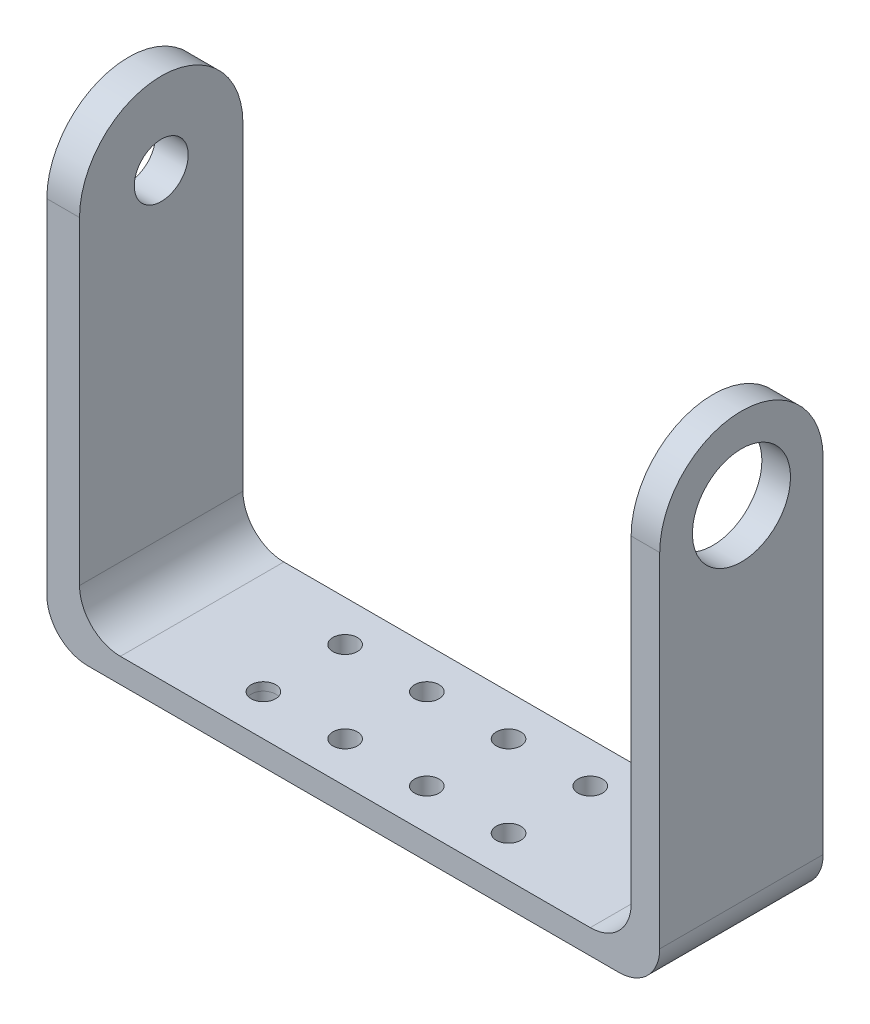
ISO-10303-21;
HEADER;
FILE_DESCRIPTION(('STEP AP214'),'2;1');
FILE_NAME('part.step','',(''),(''),'','','');
FILE_SCHEMA(('AUTOMOTIVE_DESIGN { 1 0 10303 214 1 1 1 1 }'));
ENDSEC;
DATA;
#1=APPLICATION_CONTEXT('core data for automotive mechanical design processes');
#2=APPLICATION_PROTOCOL_DEFINITION('international standard','automotive_design',2000,#1);
#3=PRODUCT_CONTEXT('',#1,'mechanical');
#4=PRODUCT('Part','Part','',(#3));
#5=PRODUCT_RELATED_PRODUCT_CATEGORY('part','',(#4));
#6=PRODUCT_DEFINITION_FORMATION('','',#4);
#7=PRODUCT_DEFINITION_CONTEXT('part definition',#1,'design');
#8=PRODUCT_DEFINITION('design','',#6,#7);
#9=PRODUCT_DEFINITION_SHAPE('','',#8);
#10=(LENGTH_UNIT() NAMED_UNIT(*) SI_UNIT(.MILLI.,.METRE.));
#11=(NAMED_UNIT(*) PLANE_ANGLE_UNIT() SI_UNIT($,.RADIAN.));
#12=(NAMED_UNIT(*) SI_UNIT($,.STERADIAN.) SOLID_ANGLE_UNIT());
#13=UNCERTAINTY_MEASURE_WITH_UNIT(LENGTH_MEASURE(1.E-05),#10,'distance_accuracy_value','');
#14=(GEOMETRIC_REPRESENTATION_CONTEXT(3) GLOBAL_UNCERTAINTY_ASSIGNED_CONTEXT((#13)) GLOBAL_UNIT_ASSIGNED_CONTEXT((#10,
#11,#12)) REPRESENTATION_CONTEXT('',''));
#15=CARTESIAN_POINT('',(0.,0.,0.));
#16=DIRECTION('',(0.,0.,1.));
#17=DIRECTION('',(1.,0.,0.));
#18=AXIS2_PLACEMENT_3D('',#15,#16,#17);
#19=CARTESIAN_POINT('',(30.,8.,-10.));
#20=DIRECTION('',(0.,0.,-1.));
#21=DIRECTION('',(-1.,0.,0.));
#22=AXIS2_PLACEMENT_3D('',#19,#20,#21);
#23=CYLINDRICAL_SURFACE('',#22,5.);
#24=DIRECTION('',(0.,0.,1.));
#25=VECTOR('',#24,1.);
#26=CARTESIAN_POINT('',(35.,8.,-10.));
#27=LINE('',#26,#25);
#28=CARTESIAN_POINT('',(35.,8.,-10.));
#29=VERTEX_POINT('',#28);
#30=CARTESIAN_POINT('',(35.,8.,10.));
#31=VERTEX_POINT('',#30);
#32=EDGE_CURVE('E273',#29,#31,#27,.T.);
#33=ORIENTED_EDGE('',*,*,#32,.F.);
#34=CARTESIAN_POINT('',(30.,8.,-10.));
#35=DIRECTION('',(0.,0.,1.));
#36=DIRECTION('',(1.,0.,0.));
#37=AXIS2_PLACEMENT_3D('',#34,#35,#36);
#38=CIRCLE('',#37,5.);
#39=CARTESIAN_POINT('',(30.,3.,-10.));
#40=VERTEX_POINT('',#39);
#41=EDGE_CURVE('E279',#29,#40,#38,.F.);
#42=ORIENTED_EDGE('',*,*,#41,.T.);
#43=DIRECTION('',(0.,0.,1.));
#44=VECTOR('',#43,1.);
#45=CARTESIAN_POINT('',(30.,3.,-10.));
#46=LINE('',#45,#44);
#47=CARTESIAN_POINT('',(30.,3.,9.99999999999999));
#48=VERTEX_POINT('',#47);
#49=EDGE_CURVE('E276',#48,#40,#46,.F.);
#50=ORIENTED_EDGE('',*,*,#49,.F.);
#51=CARTESIAN_POINT('',(30.,8.,10.));
#52=DIRECTION('',(0.,0.,-1.));
#53=DIRECTION('',(-1.,0.,0.));
#54=AXIS2_PLACEMENT_3D('',#51,#52,#53);
#55=CIRCLE('',#54,5.);
#56=EDGE_CURVE('E281',#48,#31,#55,.F.);
#57=ORIENTED_EDGE('',*,*,#56,.T.);
#58=EDGE_LOOP('',(#33,#42,#50,#57));
#59=FACE_BOUND('',#58,.T.);
#60=ADVANCED_FACE('F77',(#59),#23,.F.);
#61=CARTESIAN_POINT('',(-27.5,8.,0.));
#62=DIRECTION('',(0.,0.,-1.));
#63=DIRECTION('',(-1.,0.,0.));
#64=AXIS2_PLACEMENT_3D('',#61,#62,#63);
#65=CYLINDRICAL_SURFACE('',#64,5.);
#66=DIRECTION('',(0.,0.,1.));
#67=VECTOR('',#66,1.);
#68=CARTESIAN_POINT('',(-27.5,3.,0.));
#69=LINE('',#68,#67);
#70=CARTESIAN_POINT('',(-27.5,3.,-10.));
#71=VERTEX_POINT('',#70);
#72=CARTESIAN_POINT('',(-27.5,3.,9.99999999999999));
#73=VERTEX_POINT('',#72);
#74=EDGE_CURVE('E254',#71,#73,#69,.T.);
#75=ORIENTED_EDGE('',*,*,#74,.F.);
#76=CARTESIAN_POINT('',(-27.5,8.,-10.));
#77=DIRECTION('',(0.,0.,1.));
#78=DIRECTION('',(1.,0.,0.));
#79=AXIS2_PLACEMENT_3D('',#76,#77,#78);
#80=CIRCLE('',#79,5.);
#81=CARTESIAN_POINT('',(-32.5,8.,-10.));
#82=VERTEX_POINT('',#81);
#83=EDGE_CURVE('E269',#71,#82,#80,.F.);
#84=ORIENTED_EDGE('',*,*,#83,.T.);
#85=DIRECTION('',(0.,0.,1.));
#86=VECTOR('',#85,1.);
#87=CARTESIAN_POINT('',(-32.5,8.,0.));
#88=LINE('',#87,#86);
#89=CARTESIAN_POINT('',(-32.5,8.,10.));
#90=VERTEX_POINT('',#89);
#91=EDGE_CURVE('E266',#90,#82,#88,.F.);
#92=ORIENTED_EDGE('',*,*,#91,.F.);
#93=CARTESIAN_POINT('',(-27.5,8.,10.0000000000001));
#94=DIRECTION('',(0.,0.,-1.));
#95=DIRECTION('',(-1.,0.,0.));
#96=AXIS2_PLACEMENT_3D('',#93,#94,#95);
#97=CIRCLE('',#96,5.);
#98=EDGE_CURVE('E271',#90,#73,#97,.F.);
#99=ORIENTED_EDGE('',*,*,#98,.T.);
#100=EDGE_LOOP('',(#75,#84,#92,#99));
#101=FACE_BOUND('',#100,.T.);
#102=ADVANCED_FACE('F320',(#101),#65,.F.);
#103=CARTESIAN_POINT('',(-32.5,57.,-10.));
#104=DIRECTION('',(-1.,0.,0.));
#105=DIRECTION('',(0.,0.,1.));
#106=AXIS2_PLACEMENT_3D('',#103,#104,#105);
#107=PLANE('',#106);
#108=CARTESIAN_POINT('',(-32.5,47.,0.));
#109=DIRECTION('',(-1.,0.,0.));
#110=DIRECTION('',(0.,0.,1.));
#111=AXIS2_PLACEMENT_3D('',#108,#109,#110);
#112=CIRCLE('',#111,3.3);
#113=CARTESIAN_POINT('',(-32.5,47.,3.30000000000005));
#114=VERTEX_POINT('',#113);
#115=EDGE_CURVE('E197',#114,#114,#112,.T.);
#116=ORIENTED_EDGE('',*,*,#115,.T.);
#117=EDGE_LOOP('',(#116));
#118=FACE_BOUND('',#117,.T.);
#119=DIRECTION('',(0.,-1.,0.));
#120=VECTOR('',#119,1.);
#121=CARTESIAN_POINT('',(-32.5,57.,10.));
#122=LINE('',#121,#120);
#123=CARTESIAN_POINT('',(-32.5,47.,9.99999999999999));
#124=VERTEX_POINT('',#123);
#125=EDGE_CURVE('E224',#124,#90,#122,.T.);
#126=ORIENTED_EDGE('',*,*,#125,.T.);
#127=ORIENTED_EDGE('',*,*,#91,.T.);
#128=DIRECTION('',(0.,-1.,0.));
#129=VECTOR('',#128,1.);
#130=CARTESIAN_POINT('',(-32.5,57.,-10.));
#131=LINE('',#130,#129);
#132=CARTESIAN_POINT('',(-32.5,47.,-10.));
#133=VERTEX_POINT('',#132);
#134=EDGE_CURVE('E219',#133,#82,#131,.T.);
#135=ORIENTED_EDGE('',*,*,#134,.F.);
#136=CARTESIAN_POINT('',(-32.5,47.,0.));
#137=DIRECTION('',(-1.,0.,0.));
#138=DIRECTION('',(0.,0.,1.));
#139=AXIS2_PLACEMENT_3D('',#136,#137,#138);
#140=CIRCLE('',#139,10.);
#141=EDGE_CURVE('E184',#124,#133,#140,.T.);
#142=ORIENTED_EDGE('',*,*,#141,.F.);
#143=EDGE_LOOP('',(#126,#127,#135,#142));
#144=FACE_BOUND('',#143,.T.);
#145=ADVANCED_FACE('F314',(#118,#144),#107,.F.);
#146=CARTESIAN_POINT('',(35.,57.,-10.));
#147=DIRECTION('',(1.,0.,0.));
#148=DIRECTION('',(0.,0.,-1.));
#149=AXIS2_PLACEMENT_3D('',#146,#147,#148);
#150=PLANE('',#149);
#151=CARTESIAN_POINT('',(35.,47.,0.));
#152=DIRECTION('',(1.,0.,0.));
#153=DIRECTION('',(0.,0.,-1.));
#154=AXIS2_PLACEMENT_3D('',#151,#152,#153);
#155=CIRCLE('',#154,6.);
#156=CARTESIAN_POINT('',(35.,47.,-6.00000000000001));
#157=VERTEX_POINT('',#156);
#158=EDGE_CURVE('E203',#157,#157,#155,.T.);
#159=ORIENTED_EDGE('',*,*,#158,.T.);
#160=EDGE_LOOP('',(#159));
#161=FACE_BOUND('',#160,.T.);
#162=DIRECTION('',(0.,-1.,0.));
#163=VECTOR('',#162,1.);
#164=CARTESIAN_POINT('',(35.,57.,-10.));
#165=LINE('',#164,#163);
#166=CARTESIAN_POINT('',(35.,47.,-10.));
#167=VERTEX_POINT('',#166);
#168=EDGE_CURVE('E216',#167,#29,#165,.T.);
#169=ORIENTED_EDGE('',*,*,#168,.T.);
#170=ORIENTED_EDGE('',*,*,#32,.T.);
#171=DIRECTION('',(0.,-1.,0.));
#172=VECTOR('',#171,1.);
#173=CARTESIAN_POINT('',(35.,57.,10.));
#174=LINE('',#173,#172);
#175=CARTESIAN_POINT('',(35.,47.,9.99999999999999));
#176=VERTEX_POINT('',#175);
#177=EDGE_CURVE('E213',#176,#31,#174,.T.);
#178=ORIENTED_EDGE('',*,*,#177,.F.);
#179=CARTESIAN_POINT('',(35.,47.,0.));
#180=DIRECTION('',(1.,0.,0.));
#181=DIRECTION('',(0.,0.,-1.));
#182=AXIS2_PLACEMENT_3D('',#179,#180,#181);
#183=CIRCLE('',#182,10.);
#184=EDGE_CURVE('E185',#167,#176,#183,.T.);
#185=ORIENTED_EDGE('',*,*,#184,.F.);
#186=EDGE_LOOP('',(#169,#170,#178,#185));
#187=FACE_BOUND('',#186,.T.);
#188=ADVANCED_FACE('F456',(#161,#187),#150,.F.);
#189=CARTESIAN_POINT('',(38.5,2.,-10.));
#190=DIRECTION('',(-1.,0.,0.));
#191=DIRECTION('',(0.,0.,1.));
#192=AXIS2_PLACEMENT_3D('',#189,#190,#191);
#193=PLANE('',#192);
#194=CARTESIAN_POINT('',(38.5,47.,0.));
#195=DIRECTION('',(1.,0.,0.));
#196=DIRECTION('',(0.,0.,-1.));
#197=AXIS2_PLACEMENT_3D('',#194,#195,#196);
#198=CIRCLE('',#197,6.);
#199=CARTESIAN_POINT('',(38.5,47.,-6.00000000000001));
#200=VERTEX_POINT('',#199);
#201=EDGE_CURVE('E200',#200,#200,#198,.T.);
#202=ORIENTED_EDGE('',*,*,#201,.F.);
#203=EDGE_LOOP('',(#202));
#204=FACE_BOUND('',#203,.T.);
#205=DIRECTION('',(0.,-1.,0.));
#206=VECTOR('',#205,1.);
#207=CARTESIAN_POINT('',(38.5,2.,9.99999999999999));
#208=LINE('',#207,#206);
#209=CARTESIAN_POINT('',(38.5,47.,9.99999999999999));
#210=VERTEX_POINT('',#209);
#211=CARTESIAN_POINT('',(38.5,5.,9.99999999999999));
#212=VERTEX_POINT('',#211);
#213=EDGE_CURVE('E251',#210,#212,#208,.T.);
#214=ORIENTED_EDGE('',*,*,#213,.T.);
#215=DIRECTION('',(0.,0.,-1.));
#216=VECTOR('',#215,1.);
#217=CARTESIAN_POINT('',(38.5,5.,-10.));
#218=LINE('',#217,#216);
#219=CARTESIAN_POINT('',(38.5,5.,-10.));
#220=VERTEX_POINT('',#219);
#221=EDGE_CURVE('E283',#212,#220,#218,.T.);
#222=ORIENTED_EDGE('',*,*,#221,.T.);
#223=DIRECTION('',(0.,-1.,0.));
#224=VECTOR('',#223,1.);
#225=CARTESIAN_POINT('',(38.5,2.,-10.));
#226=LINE('',#225,#224);
#227=CARTESIAN_POINT('',(38.5,47.,-10.));
#228=VERTEX_POINT('',#227);
#229=EDGE_CURVE('E249',#228,#220,#226,.T.);
#230=ORIENTED_EDGE('',*,*,#229,.F.);
#231=CARTESIAN_POINT('',(38.5,47.,0.));
#232=DIRECTION('',(1.,0.,0.));
#233=DIRECTION('',(0.,0.,-1.));
#234=AXIS2_PLACEMENT_3D('',#231,#232,#233);
#235=CIRCLE('',#234,10.);
#236=EDGE_CURVE('E208',#228,#210,#235,.T.);
#237=ORIENTED_EDGE('',*,*,#236,.T.);
#238=EDGE_LOOP('',(#214,#222,#230,#237));
#239=FACE_BOUND('',#238,.T.);
#240=ADVANCED_FACE('F302',(#204,#239),#193,.F.);
#241=CARTESIAN_POINT('',(35.,2.,10.));
#242=DIRECTION('',(0.,0.,-1.));
#243=DIRECTION('',(-1.,0.,0.));
#244=AXIS2_PLACEMENT_3D('',#241,#242,#243);
#245=PLANE('',#244);
#246=DIRECTION('',(1.,0.,0.));
#247=VECTOR('',#246,1.);
#248=CARTESIAN_POINT('',(35.,0.,10.));
#249=LINE('',#248,#247);
#250=CARTESIAN_POINT('',(-31.5,0.,10.0000000000001));
#251=VERTEX_POINT('',#250);
#252=CARTESIAN_POINT('',(33.5,0.,10.));
#253=VERTEX_POINT('',#252);
#254=EDGE_CURVE('E245',#251,#253,#249,.T.);
#255=ORIENTED_EDGE('',*,*,#254,.T.);
#256=CARTESIAN_POINT('',(33.5,5.,10.));
#257=DIRECTION('',(0.,0.,-1.));
#258=DIRECTION('',(-1.,0.,0.));
#259=AXIS2_PLACEMENT_3D('',#256,#257,#258);
#260=CIRCLE('',#259,5.);
#261=EDGE_CURVE('E85',#253,#212,#260,.F.);
#262=ORIENTED_EDGE('',*,*,#261,.T.);
#263=ORIENTED_EDGE('',*,*,#213,.F.);
#264=DIRECTION('',(1.,0.,0.));
#265=VECTOR('',#264,1.);
#266=CARTESIAN_POINT('',(-48.5,47.,9.99999999999999));
#267=LINE('',#266,#265);
#268=EDGE_CURVE('E204',#176,#210,#267,.T.);
#269=ORIENTED_EDGE('',*,*,#268,.F.);
#270=ORIENTED_EDGE('',*,*,#177,.T.);
#271=ORIENTED_EDGE('',*,*,#56,.F.);
#272=DIRECTION('',(1.,0.,0.));
#273=VECTOR('',#272,1.);
#274=CARTESIAN_POINT('',(-32.5,3.,9.99999999999999));
#275=LINE('',#274,#273);
#276=EDGE_CURVE('E325',#73,#48,#275,.T.);
#277=ORIENTED_EDGE('',*,*,#276,.F.);
#278=ORIENTED_EDGE('',*,*,#98,.F.);
#279=ORIENTED_EDGE('',*,*,#125,.F.);
#280=CARTESIAN_POINT('',(-36.5,47.,9.99999999999999));
#281=VERTEX_POINT('',#280);
#282=EDGE_CURVE('E207',#281,#124,#267,.T.);
#283=ORIENTED_EDGE('',*,*,#282,.F.);
#284=DIRECTION('',(0.,-1.,0.));
#285=VECTOR('',#284,1.);
#286=CARTESIAN_POINT('',(-36.5,0.,10.));
#287=LINE('',#286,#285);
#288=CARTESIAN_POINT('',(-36.5,5.,10.));
#289=VERTEX_POINT('',#288);
#290=EDGE_CURVE('E177',#281,#289,#287,.T.);
#291=ORIENTED_EDGE('',*,*,#290,.T.);
#292=CARTESIAN_POINT('',(-31.5,5.,10.0000000000001));
#293=DIRECTION('',(0.,0.,-1.));
#294=DIRECTION('',(-1.,0.,0.));
#295=AXIS2_PLACEMENT_3D('',#292,#293,#294);
#296=CIRCLE('',#295,5.);
#297=EDGE_CURVE('E293',#289,#251,#296,.F.);
#298=ORIENTED_EDGE('',*,*,#297,.T.);
#299=EDGE_LOOP('',(#255,#262,#263,#269,#270,#271,#277,#278,#279,#283,#291,#298));
#300=FACE_BOUND('',#299,.T.);
#301=ADVANCED_FACE('F297',(#300),#245,.F.);
#302=CARTESIAN_POINT('',(0.,0.,0.));
#303=DIRECTION('',(0.,1.,0.));
#304=DIRECTION('',(0.,0.,1.));
#305=AXIS2_PLACEMENT_3D('',#302,#303,#304);
#306=PLANE('',#305);
#307=DIRECTION('',(-1.,0.,0.));
#308=VECTOR('',#307,1.);
#309=CARTESIAN_POINT('',(35.,0.,-10.));
#310=LINE('',#309,#308);
#311=CARTESIAN_POINT('',(33.5,0.,-10.));
#312=VERTEX_POINT('',#311);
#313=CARTESIAN_POINT('',(-31.5,0.,-10.));
#314=VERTEX_POINT('',#313);
#315=EDGE_CURVE('E247',#312,#314,#310,.T.);
#316=ORIENTED_EDGE('',*,*,#315,.F.);
#317=DIRECTION('',(0.,0.,-1.));
#318=VECTOR('',#317,1.);
#319=CARTESIAN_POINT('',(33.5,0.,0.));
#320=LINE('',#319,#318);
#321=EDGE_CURVE('E98',#312,#253,#320,.F.);
#322=ORIENTED_EDGE('',*,*,#321,.T.);
#323=ORIENTED_EDGE('',*,*,#254,.F.);
#324=DIRECTION('',(0.,0.,-1.));
#325=VECTOR('',#324,1.);
#326=CARTESIAN_POINT('',(-31.5,0.,-10.));
#327=LINE('',#326,#325);
#328=EDGE_CURVE('E289',#251,#314,#327,.T.);
#329=ORIENTED_EDGE('',*,*,#328,.T.);
#330=EDGE_LOOP('',(#316,#322,#323,#329));
#331=FACE_BOUND('',#330,.T.);
#332=CARTESIAN_POINT('',(-15.,0.,-5.));
#333=DIRECTION('',(0.,1.,0.));
#334=DIRECTION('',(0.,0.,1.));
#335=AXIS2_PLACEMENT_3D('',#332,#333,#334);
#336=CIRCLE('',#335,1.5);
#337=CARTESIAN_POINT('',(-15.,0.,-3.5));
#338=VERTEX_POINT('',#337);
#339=EDGE_CURVE('E242',#338,#338,#336,.T.);
#340=ORIENTED_EDGE('',*,*,#339,.T.);
#341=EDGE_LOOP('',(#340));
#342=FACE_BOUND('',#341,.T.);
#343=CARTESIAN_POINT('',(-5.,0.,-5.));
#344=DIRECTION('',(0.,1.,0.));
#345=DIRECTION('',(0.,0.,1.));
#346=AXIS2_PLACEMENT_3D('',#343,#344,#345);
#347=CIRCLE('',#346,1.5);
#348=CARTESIAN_POINT('',(-5.,0.,-3.5));
#349=VERTEX_POINT('',#348);
#350=EDGE_CURVE('E239',#349,#349,#347,.T.);
#351=ORIENTED_EDGE('',*,*,#350,.T.);
#352=EDGE_LOOP('',(#351));
#353=FACE_BOUND('',#352,.T.);
#354=CARTESIAN_POINT('',(-15.,0.,5.));
#355=DIRECTION('',(0.,1.,0.));
#356=DIRECTION('',(0.,0.,1.));
#357=AXIS2_PLACEMENT_3D('',#354,#355,#356);
#358=CIRCLE('',#357,1.5);
#359=CARTESIAN_POINT('',(-15.,0.,6.5));
#360=VERTEX_POINT('',#359);
#361=EDGE_CURVE('E236',#360,#360,#358,.T.);
#362=ORIENTED_EDGE('',*,*,#361,.T.);
#363=EDGE_LOOP('',(#362));
#364=FACE_BOUND('',#363,.T.);
#365=CARTESIAN_POINT('',(-5.,0.,5.));
#366=DIRECTION('',(0.,1.,0.));
#367=DIRECTION('',(0.,0.,1.));
#368=AXIS2_PLACEMENT_3D('',#365,#366,#367);
#369=CIRCLE('',#368,1.5);
#370=CARTESIAN_POINT('',(-5.,0.,6.5));
#371=VERTEX_POINT('',#370);
#372=EDGE_CURVE('E233',#371,#371,#369,.T.);
#373=ORIENTED_EDGE('',*,*,#372,.T.);
#374=EDGE_LOOP('',(#373));
#375=FACE_BOUND('',#374,.T.);
#376=CARTESIAN_POINT('',(15.,0.,5.));
#377=DIRECTION('',(0.,1.,0.));
#378=DIRECTION('',(0.,0.,-1.));
#379=AXIS2_PLACEMENT_3D('',#376,#377,#378);
#380=CIRCLE('',#379,1.5);
#381=CARTESIAN_POINT('',(15.,0.,3.5));
#382=VERTEX_POINT('',#381);
#383=EDGE_CURVE('E230',#382,#382,#380,.T.);
#384=ORIENTED_EDGE('',*,*,#383,.T.);
#385=EDGE_LOOP('',(#384));
#386=FACE_BOUND('',#385,.T.);
#387=CARTESIAN_POINT('',(5.,0.,5.));
#388=DIRECTION('',(0.,1.,0.));
#389=DIRECTION('',(0.,0.,-1.));
#390=AXIS2_PLACEMENT_3D('',#387,#388,#389);
#391=CIRCLE('',#390,1.5);
#392=CARTESIAN_POINT('',(5.,0.,3.5));
#393=VERTEX_POINT('',#392);
#394=EDGE_CURVE('E227',#393,#393,#391,.T.);
#395=ORIENTED_EDGE('',*,*,#394,.T.);
#396=EDGE_LOOP('',(#395));
#397=FACE_BOUND('',#396,.T.);
#398=CARTESIAN_POINT('',(5.,0.,-5.));
#399=DIRECTION('',(0.,1.,0.));
#400=DIRECTION('',(0.,0.,-1.));
#401=AXIS2_PLACEMENT_3D('',#398,#399,#400);
#402=CIRCLE('',#401,1.5);
#403=CARTESIAN_POINT('',(5.,0.,-6.5));
#404=VERTEX_POINT('',#403);
#405=EDGE_CURVE('E223',#404,#404,#402,.T.);
#406=ORIENTED_EDGE('',*,*,#405,.T.);
#407=EDGE_LOOP('',(#406));
#408=FACE_BOUND('',#407,.T.);
#409=CARTESIAN_POINT('',(15.,0.,-5.));
#410=DIRECTION('',(0.,1.,0.));
#411=DIRECTION('',(0.,0.,-1.));
#412=AXIS2_PLACEMENT_3D('',#409,#410,#411);
#413=CIRCLE('',#412,1.5);
#414=CARTESIAN_POINT('',(15.,0.,-6.5));
#415=VERTEX_POINT('',#414);
#416=EDGE_CURVE('E220',#415,#415,#413,.T.);
#417=ORIENTED_EDGE('',*,*,#416,.T.);
#418=EDGE_LOOP('',(#417));
#419=FACE_BOUND('',#418,.T.);
#420=ADVANCED_FACE('F305',(#331,#342,#353,#364,#375,#386,#397,#408,#419),#306,.F.);
#421=CARTESIAN_POINT('',(35.,2.,-10.));
#422=DIRECTION('',(0.,0.,1.));
#423=DIRECTION('',(1.,0.,0.));
#424=AXIS2_PLACEMENT_3D('',#421,#422,#423);
#425=PLANE('',#424);
#426=ORIENTED_EDGE('',*,*,#229,.T.);
#427=CARTESIAN_POINT('',(33.5,5.,-10.));
#428=DIRECTION('',(0.,0.,1.));
#429=DIRECTION('',(1.,0.,0.));
#430=AXIS2_PLACEMENT_3D('',#427,#428,#429);
#431=CIRCLE('',#430,5.);
#432=EDGE_CURVE('E287',#220,#312,#431,.F.);
#433=ORIENTED_EDGE('',*,*,#432,.T.);
#434=ORIENTED_EDGE('',*,*,#315,.T.);
#435=CARTESIAN_POINT('',(-31.5,5.,-10.));
#436=DIRECTION('',(0.,0.,1.));
#437=DIRECTION('',(1.,0.,0.));
#438=AXIS2_PLACEMENT_3D('',#435,#436,#437);
#439=CIRCLE('',#438,5.);
#440=CARTESIAN_POINT('',(-36.5,5.,-10.));
#441=VERTEX_POINT('',#440);
#442=EDGE_CURVE('E175',#314,#441,#439,.F.);
#443=ORIENTED_EDGE('',*,*,#442,.T.);
#444=DIRECTION('',(0.,1.,0.));
#445=VECTOR('',#444,1.);
#446=CARTESIAN_POINT('',(-36.5,0.,-10.));
#447=LINE('',#446,#445);
#448=CARTESIAN_POINT('',(-36.5,47.,-10.));
#449=VERTEX_POINT('',#448);
#450=EDGE_CURVE('E167',#441,#449,#447,.T.);
#451=ORIENTED_EDGE('',*,*,#450,.T.);
#452=DIRECTION('',(1.,0.,0.));
#453=VECTOR('',#452,1.);
#454=CARTESIAN_POINT('',(-48.5,47.,-10.));
#455=LINE('',#454,#453);
#456=EDGE_CURVE('E172',#449,#133,#455,.T.);
#457=ORIENTED_EDGE('',*,*,#456,.T.);
#458=ORIENTED_EDGE('',*,*,#134,.T.);
#459=ORIENTED_EDGE('',*,*,#83,.F.);
#460=DIRECTION('',(-1.,0.,0.));
#461=VECTOR('',#460,1.);
#462=CARTESIAN_POINT('',(-32.5,3.,-10.));
#463=LINE('',#462,#461);
#464=EDGE_CURVE('E318',#40,#71,#463,.T.);
#465=ORIENTED_EDGE('',*,*,#464,.F.);
#466=ORIENTED_EDGE('',*,*,#41,.F.);
#467=ORIENTED_EDGE('',*,*,#168,.F.);
#468=EDGE_CURVE('E186',#167,#228,#455,.T.);
#469=ORIENTED_EDGE('',*,*,#468,.T.);
#470=EDGE_LOOP('',(#426,#433,#434,#443,#451,#457,#458,#459,#465,#466,#467,#469));
#471=FACE_BOUND('',#470,.T.);
#472=ADVANCED_FACE('F170',(#471),#425,.F.);
#473=CARTESIAN_POINT('',(-15.,2.,-5.));
#474=DIRECTION('',(0.,-1.,0.));
#475=DIRECTION('',(0.,0.,-1.));
#476=AXIS2_PLACEMENT_3D('',#473,#474,#475);
#477=CYLINDRICAL_SURFACE('',#476,1.5);
#478=ORIENTED_EDGE('',*,*,#339,.F.);
#479=EDGE_LOOP('',(#478));
#480=FACE_BOUND('',#479,.T.);
#481=CARTESIAN_POINT('',(-15.,3.,-5.));
#482=DIRECTION('',(0.,1.,0.));
#483=DIRECTION('',(0.,0.,1.));
#484=AXIS2_PLACEMENT_3D('',#481,#482,#483);
#485=CIRCLE('',#484,1.5);
#486=CARTESIAN_POINT('',(-15.,3.,-3.5));
#487=VERTEX_POINT('',#486);
#488=EDGE_CURVE('E327',#487,#487,#485,.T.);
#489=ORIENTED_EDGE('',*,*,#488,.T.);
#490=EDGE_LOOP('',(#489));
#491=FACE_BOUND('',#490,.T.);
#492=ADVANCED_FACE('F496',(#480,#491),#477,.F.);
#493=CARTESIAN_POINT('',(-5.,2.,-5.));
#494=DIRECTION('',(0.,-1.,0.));
#495=DIRECTION('',(0.,0.,-1.));
#496=AXIS2_PLACEMENT_3D('',#493,#494,#495);
#497=CYLINDRICAL_SURFACE('',#496,1.5);
#498=ORIENTED_EDGE('',*,*,#350,.F.);
#499=EDGE_LOOP('',(#498));
#500=FACE_BOUND('',#499,.T.);
#501=CARTESIAN_POINT('',(-5.,3.,-5.));
#502=DIRECTION('',(0.,1.,0.));
#503=DIRECTION('',(0.,0.,1.));
#504=AXIS2_PLACEMENT_3D('',#501,#502,#503);
#505=CIRCLE('',#504,1.5);
#506=CARTESIAN_POINT('',(-5.,3.,-3.5));
#507=VERTEX_POINT('',#506);
#508=EDGE_CURVE('E331',#507,#507,#505,.T.);
#509=ORIENTED_EDGE('',*,*,#508,.T.);
#510=EDGE_LOOP('',(#509));
#511=FACE_BOUND('',#510,.T.);
#512=ADVANCED_FACE('F344',(#500,#511),#497,.F.);
#513=CARTESIAN_POINT('',(-15.,2.,5.));
#514=DIRECTION('',(0.,-1.,0.));
#515=DIRECTION('',(0.,0.,-1.));
#516=AXIS2_PLACEMENT_3D('',#513,#514,#515);
#517=CYLINDRICAL_SURFACE('',#516,1.5);
#518=CARTESIAN_POINT('',(-15.,2.,5.));
#519=DIRECTION('',(0.,-1.,0.));
#520=DIRECTION('',(0.,0.,-1.));
#521=AXIS2_PLACEMENT_3D('',#518,#519,#520);
#522=CIRCLE('',#521,1.5);
#523=CARTESIAN_POINT('',(-15.,2.,3.50000000000001));
#524=VERTEX_POINT('',#523);
#525=EDGE_CURVE('E192',#524,#524,#522,.T.);
#526=ORIENTED_EDGE('',*,*,#525,.F.);
#527=EDGE_LOOP('',(#526));
#528=FACE_BOUND('',#527,.T.);
#529=ORIENTED_EDGE('',*,*,#361,.F.);
#530=EDGE_LOOP('',(#529));
#531=FACE_BOUND('',#530,.T.);
#532=ADVANCED_FACE('F340',(#528,#531),#517,.F.);
#533=CARTESIAN_POINT('',(-5.,2.,5.));
#534=DIRECTION('',(0.,-1.,0.));
#535=DIRECTION('',(0.,0.,-1.));
#536=AXIS2_PLACEMENT_3D('',#533,#534,#535);
#537=CYLINDRICAL_SURFACE('',#536,1.5);
#538=ORIENTED_EDGE('',*,*,#372,.F.);
#539=EDGE_LOOP('',(#538));
#540=FACE_BOUND('',#539,.T.);
#541=CARTESIAN_POINT('',(-5.,3.,5.));
#542=DIRECTION('',(0.,1.,0.));
#543=DIRECTION('',(0.,0.,1.));
#544=AXIS2_PLACEMENT_3D('',#541,#542,#543);
#545=CIRCLE('',#544,1.5);
#546=CARTESIAN_POINT('',(-5.,3.,6.5));
#547=VERTEX_POINT('',#546);
#548=EDGE_CURVE('E397',#547,#547,#545,.T.);
#549=ORIENTED_EDGE('',*,*,#548,.T.);
#550=EDGE_LOOP('',(#549));
#551=FACE_BOUND('',#550,.T.);
#552=ADVANCED_FACE('F343',(#540,#551),#537,.F.);
#553=CARTESIAN_POINT('',(15.,2.,5.));
#554=DIRECTION('',(0.,-1.,0.));
#555=DIRECTION('',(0.,0.,-1.));
#556=AXIS2_PLACEMENT_3D('',#553,#554,#555);
#557=CYLINDRICAL_SURFACE('',#556,1.5);
#558=ORIENTED_EDGE('',*,*,#383,.F.);
#559=EDGE_LOOP('',(#558));
#560=FACE_BOUND('',#559,.T.);
#561=CARTESIAN_POINT('',(15.,3.,5.));
#562=DIRECTION('',(0.,1.,0.));
#563=DIRECTION('',(0.,0.,1.));
#564=AXIS2_PLACEMENT_3D('',#561,#562,#563);
#565=CIRCLE('',#564,1.5);
#566=CARTESIAN_POINT('',(15.,3.,6.5));
#567=VERTEX_POINT('',#566);
#568=EDGE_CURVE('E372',#567,#567,#565,.T.);
#569=ORIENTED_EDGE('',*,*,#568,.T.);
#570=EDGE_LOOP('',(#569));
#571=FACE_BOUND('',#570,.T.);
#572=ADVANCED_FACE('F410',(#560,#571),#557,.F.);
#573=CARTESIAN_POINT('',(5.,2.,5.));
#574=DIRECTION('',(0.,-1.,0.));
#575=DIRECTION('',(0.,0.,-1.));
#576=AXIS2_PLACEMENT_3D('',#573,#574,#575);
#577=CYLINDRICAL_SURFACE('',#576,1.5);
#578=ORIENTED_EDGE('',*,*,#394,.F.);
#579=EDGE_LOOP('',(#578));
#580=FACE_BOUND('',#579,.T.);
#581=CARTESIAN_POINT('',(5.,3.,5.));
#582=DIRECTION('',(0.,1.,0.));
#583=DIRECTION('',(0.,0.,1.));
#584=AXIS2_PLACEMENT_3D('',#581,#582,#583);
#585=CIRCLE('',#584,1.5);
#586=CARTESIAN_POINT('',(5.,3.,6.5));
#587=VERTEX_POINT('',#586);
#588=EDGE_CURVE('E377',#587,#587,#585,.T.);
#589=ORIENTED_EDGE('',*,*,#588,.T.);
#590=EDGE_LOOP('',(#589));
#591=FACE_BOUND('',#590,.T.);
#592=ADVANCED_FACE('F408',(#580,#591),#577,.F.);
#593=CARTESIAN_POINT('',(5.,2.,-5.));
#594=DIRECTION('',(0.,-1.,0.));
#595=DIRECTION('',(0.,0.,-1.));
#596=AXIS2_PLACEMENT_3D('',#593,#594,#595);
#597=CYLINDRICAL_SURFACE('',#596,1.5);
#598=ORIENTED_EDGE('',*,*,#405,.F.);
#599=EDGE_LOOP('',(#598));
#600=FACE_BOUND('',#599,.T.);
#601=CARTESIAN_POINT('',(5.,3.,-5.));
#602=DIRECTION('',(0.,1.,0.));
#603=DIRECTION('',(0.,0.,1.));
#604=AXIS2_PLACEMENT_3D('',#601,#602,#603);
#605=CIRCLE('',#604,1.5);
#606=CARTESIAN_POINT('',(5.,3.,-3.5));
#607=VERTEX_POINT('',#606);
#608=EDGE_CURVE('E371',#607,#607,#605,.T.);
#609=ORIENTED_EDGE('',*,*,#608,.T.);
#610=EDGE_LOOP('',(#609));
#611=FACE_BOUND('',#610,.T.);
#612=ADVANCED_FACE('F365',(#600,#611),#597,.F.);
#613=CARTESIAN_POINT('',(15.,2.,-5.));
#614=DIRECTION('',(0.,-1.,0.));
#615=DIRECTION('',(0.,0.,-1.));
#616=AXIS2_PLACEMENT_3D('',#613,#614,#615);
#617=CYLINDRICAL_SURFACE('',#616,1.5);
#618=ORIENTED_EDGE('',*,*,#416,.F.);
#619=EDGE_LOOP('',(#618));
#620=FACE_BOUND('',#619,.T.);
#621=CARTESIAN_POINT('',(15.,3.,-5.));
#622=DIRECTION('',(0.,1.,0.));
#623=DIRECTION('',(0.,0.,1.));
#624=AXIS2_PLACEMENT_3D('',#621,#622,#623);
#625=CIRCLE('',#624,1.5);
#626=CARTESIAN_POINT('',(15.,3.,-3.5));
#627=VERTEX_POINT('',#626);
#628=EDGE_CURVE('E369',#627,#627,#625,.T.);
#629=ORIENTED_EDGE('',*,*,#628,.T.);
#630=EDGE_LOOP('',(#629));
#631=FACE_BOUND('',#630,.T.);
#632=ADVANCED_FACE('F361',(#620,#631),#617,.F.);
#633=CARTESIAN_POINT('',(-48.5,47.,0.));
#634=DIRECTION('',(1.,0.,0.));
#635=DIRECTION('',(0.,0.,-1.));
#636=AXIS2_PLACEMENT_3D('',#633,#634,#635);
#637=CYLINDRICAL_SURFACE('',#636,10.);
#638=ORIENTED_EDGE('',*,*,#184,.T.);
#639=ORIENTED_EDGE('',*,*,#268,.T.);
#640=ORIENTED_EDGE('',*,*,#236,.F.);
#641=ORIENTED_EDGE('',*,*,#468,.F.);
#642=EDGE_LOOP('',(#638,#639,#640,#641));
#643=FACE_BOUND('',#642,.T.);
#644=ADVANCED_FACE('F364',(#643),#637,.T.);
#645=ORIENTED_EDGE('',*,*,#456,.F.);
#646=CARTESIAN_POINT('',(-36.5,47.,0.));
#647=DIRECTION('',(-1.,0.,0.));
#648=DIRECTION('',(0.,0.,1.));
#649=AXIS2_PLACEMENT_3D('',#646,#647,#648);
#650=CIRCLE('',#649,10.);
#651=EDGE_CURVE('E178',#449,#281,#650,.F.);
#652=ORIENTED_EDGE('',*,*,#651,.T.);
#653=ORIENTED_EDGE('',*,*,#282,.T.);
#654=ORIENTED_EDGE('',*,*,#141,.T.);
#655=EDGE_LOOP('',(#645,#652,#653,#654));
#656=FACE_BOUND('',#655,.T.);
#657=ADVANCED_FACE('F182',(#656),#637,.T.);
#658=CARTESIAN_POINT('',(-48.5,47.,0.));
#659=DIRECTION('',(1.,0.,0.));
#660=DIRECTION('',(0.,0.,-1.));
#661=AXIS2_PLACEMENT_3D('',#658,#659,#660);
#662=CYLINDRICAL_SURFACE('',#661,6.);
#663=ORIENTED_EDGE('',*,*,#201,.T.);
#664=EDGE_LOOP('',(#663));
#665=FACE_BOUND('',#664,.T.);
#666=ORIENTED_EDGE('',*,*,#158,.F.);
#667=EDGE_LOOP('',(#666));
#668=FACE_BOUND('',#667,.T.);
#669=ADVANCED_FACE('F449',(#665,#668),#662,.F.);
#670=CARTESIAN_POINT('',(-32.5,47.,0.));
#671=DIRECTION('',(-1.,0.,0.));
#672=DIRECTION('',(0.,0.,1.));
#673=AXIS2_PLACEMENT_3D('',#670,#671,#672);
#674=CYLINDRICAL_SURFACE('',#673,3.3);
#675=ORIENTED_EDGE('',*,*,#115,.F.);
#676=EDGE_LOOP('',(#675));
#677=FACE_BOUND('',#676,.T.);
#678=CARTESIAN_POINT('',(-36.5,47.,0.));
#679=DIRECTION('',(-1.,0.,0.));
#680=DIRECTION('',(0.,0.,1.));
#681=AXIS2_PLACEMENT_3D('',#678,#679,#680);
#682=CIRCLE('',#681,3.3);
#683=CARTESIAN_POINT('',(-36.5,47.,3.30000000000005));
#684=VERTEX_POINT('',#683);
#685=EDGE_CURVE('E189',#684,#684,#682,.T.);
#686=ORIENTED_EDGE('',*,*,#685,.T.);
#687=EDGE_LOOP('',(#686));
#688=FACE_BOUND('',#687,.T.);
#689=ADVANCED_FACE('F445',(#677,#688),#674,.F.);
#690=CARTESIAN_POINT('',(-36.5,0.,0.));
#691=DIRECTION('',(-1.,0.,0.));
#692=DIRECTION('',(0.,0.,1.));
#693=AXIS2_PLACEMENT_3D('',#690,#691,#692);
#694=PLANE('',#693);
#695=ORIENTED_EDGE('',*,*,#685,.F.);
#696=EDGE_LOOP('',(#695));
#697=FACE_BOUND('',#696,.T.);
#698=ORIENTED_EDGE('',*,*,#450,.F.);
#699=DIRECTION('',(0.,0.,-1.));
#700=VECTOR('',#699,1.);
#701=CARTESIAN_POINT('',(-36.5,5.,10.));
#702=LINE('',#701,#700);
#703=EDGE_CURVE('E12',#441,#289,#702,.F.);
#704=ORIENTED_EDGE('',*,*,#703,.T.);
#705=ORIENTED_EDGE('',*,*,#290,.F.);
#706=ORIENTED_EDGE('',*,*,#651,.F.);
#707=EDGE_LOOP('',(#698,#704,#705,#706));
#708=FACE_BOUND('',#707,.T.);
#709=ADVANCED_FACE('F188',(#697,#708),#694,.T.);
#710=CARTESIAN_POINT('',(0.,3.,0.));
#711=DIRECTION('',(0.,-1.,0.));
#712=DIRECTION('',(0.,0.,-1.));
#713=AXIS2_PLACEMENT_3D('',#710,#711,#712);
#714=PLANE('',#713);
#715=ORIENTED_EDGE('',*,*,#276,.T.);
#716=ORIENTED_EDGE('',*,*,#49,.T.);
#717=ORIENTED_EDGE('',*,*,#464,.T.);
#718=ORIENTED_EDGE('',*,*,#74,.T.);
#719=EDGE_LOOP('',(#715,#716,#717,#718));
#720=FACE_BOUND('',#719,.T.);
#721=ORIENTED_EDGE('',*,*,#488,.F.);
#722=EDGE_LOOP('',(#721));
#723=FACE_BOUND('',#722,.T.);
#724=ORIENTED_EDGE('',*,*,#508,.F.);
#725=EDGE_LOOP('',(#724));
#726=FACE_BOUND('',#725,.T.);
#727=ORIENTED_EDGE('',*,*,#608,.F.);
#728=EDGE_LOOP('',(#727));
#729=FACE_BOUND('',#728,.T.);
#730=ORIENTED_EDGE('',*,*,#628,.F.);
#731=EDGE_LOOP('',(#730));
#732=FACE_BOUND('',#731,.T.);
#733=ORIENTED_EDGE('',*,*,#568,.F.);
#734=EDGE_LOOP('',(#733));
#735=FACE_BOUND('',#734,.T.);
#736=ORIENTED_EDGE('',*,*,#588,.F.);
#737=EDGE_LOOP('',(#736));
#738=FACE_BOUND('',#737,.T.);
#739=ORIENTED_EDGE('',*,*,#548,.F.);
#740=EDGE_LOOP('',(#739));
#741=FACE_BOUND('',#740,.T.);
#742=CARTESIAN_POINT('',(-15.,3.,5.));
#743=DIRECTION('',(0.,1.,0.));
#744=DIRECTION('',(0.,0.,1.));
#745=AXIS2_PLACEMENT_3D('',#742,#743,#744);
#746=CIRCLE('',#745,1.49887169518485);
#747=CARTESIAN_POINT('',(-15.,3.,6.49887169518485));
#748=VERTEX_POINT('',#747);
#749=EDGE_CURVE('E400',#748,#748,#746,.T.);
#750=ORIENTED_EDGE('',*,*,#749,.F.);
#751=EDGE_LOOP('',(#750));
#752=FACE_BOUND('',#751,.T.);
#753=ADVANCED_FACE('F323',(#720,#723,#726,#729,#732,#735,#738,#741,#752),#714,.F.);
#754=CARTESIAN_POINT('',(0.,2.,0.));
#755=DIRECTION('',(0.,-1.,0.));
#756=DIRECTION('',(0.,0.,-1.));
#757=AXIS2_PLACEMENT_3D('',#754,#755,#756);
#758=PLANE('',#757);
#759=ORIENTED_EDGE('',*,*,#525,.T.);
#760=EDGE_LOOP('',(#759));
#761=FACE_BOUND('',#760,.T.);
#762=CARTESIAN_POINT('',(-15.,2.,5.));
#763=DIRECTION('',(0.,1.,0.));
#764=DIRECTION('',(0.,0.,1.));
#765=AXIS2_PLACEMENT_3D('',#762,#763,#764);
#766=CIRCLE('',#765,1.49887169518485);
#767=CARTESIAN_POINT('',(-15.,2.,6.49887169518485));
#768=VERTEX_POINT('',#767);
#769=EDGE_CURVE('E402',#768,#768,#766,.T.);
#770=ORIENTED_EDGE('',*,*,#769,.T.);
#771=EDGE_LOOP('',(#770));
#772=FACE_BOUND('',#771,.T.);
#773=ADVANCED_FACE('F337',(#761,#772),#758,.T.);
#774=CARTESIAN_POINT('',(-15.,3.,5.));
#775=DIRECTION('',(0.,-1.,0.));
#776=DIRECTION('',(0.,0.,-1.));
#777=AXIS2_PLACEMENT_3D('',#774,#775,#776);
#778=CYLINDRICAL_SURFACE('',#777,1.49887169518485);
#779=ORIENTED_EDGE('',*,*,#749,.T.);
#780=EDGE_LOOP('',(#779));
#781=FACE_BOUND('',#780,.T.);
#782=ORIENTED_EDGE('',*,*,#769,.F.);
#783=EDGE_LOOP('',(#782));
#784=FACE_BOUND('',#783,.T.);
#785=ADVANCED_FACE('F431',(#781,#784),#778,.F.);
#786=CARTESIAN_POINT('',(33.5,5.,-10.));
#787=DIRECTION('',(0.,0.,-1.));
#788=DIRECTION('',(-1.,0.,0.));
#789=AXIS2_PLACEMENT_3D('',#786,#787,#788);
#790=CYLINDRICAL_SURFACE('',#789,5.);
#791=ORIENTED_EDGE('',*,*,#261,.F.);
#792=ORIENTED_EDGE('',*,*,#321,.F.);
#793=ORIENTED_EDGE('',*,*,#432,.F.);
#794=ORIENTED_EDGE('',*,*,#221,.F.);
#795=EDGE_LOOP('',(#791,#792,#793,#794));
#796=FACE_BOUND('',#795,.T.);
#797=ADVANCED_FACE('F304',(#796),#790,.T.);
#798=CARTESIAN_POINT('',(-31.5,5.,0.));
#799=DIRECTION('',(0.,0.,1.));
#800=DIRECTION('',(1.,0.,0.));
#801=AXIS2_PLACEMENT_3D('',#798,#799,#800);
#802=CYLINDRICAL_SURFACE('',#801,5.);
#803=ORIENTED_EDGE('',*,*,#297,.F.);
#804=ORIENTED_EDGE('',*,*,#703,.F.);
#805=ORIENTED_EDGE('',*,*,#442,.F.);
#806=ORIENTED_EDGE('',*,*,#328,.F.);
#807=EDGE_LOOP('',(#803,#804,#805,#806));
#808=FACE_BOUND('',#807,.T.);
#809=ADVANCED_FACE('F79',(#808),#802,.T.);
#810=CLOSED_SHELL('',(#60,#102,#145,#188,#240,#301,#420,#472,#492,#512,#532,#552,#572,#592,#612,
#632,#644,#657,#669,#689,#709,#753,#773,#785,#797,#809));
#811=MANIFOLD_SOLID_BREP('B2',#810);
#812=ADVANCED_BREP_SHAPE_REPRESENTATION('',(#18,#811),#14);
#813=SHAPE_DEFINITION_REPRESENTATION(#9,#812);
ENDSEC;
END-ISO-10303-21;
